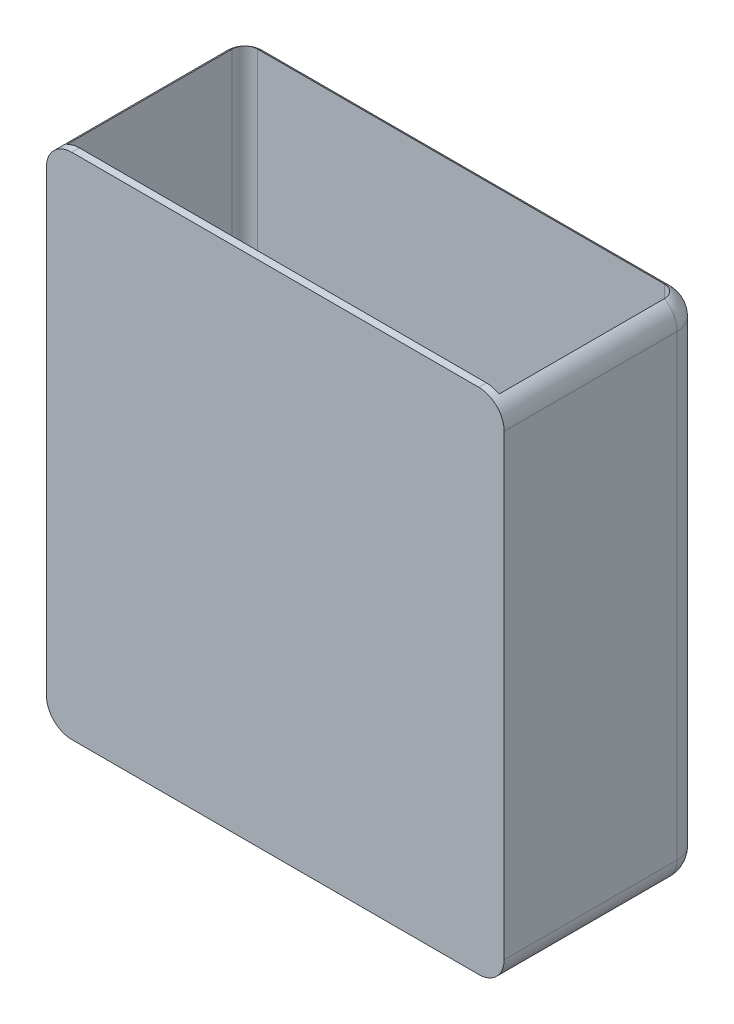
ISO-10303-21;
HEADER;
FILE_DESCRIPTION(('STEP AP214'),'2;1');
FILE_NAME('part.step','',(''),(''),'','','');
FILE_SCHEMA(('AUTOMOTIVE_DESIGN { 1 0 10303 214 1 1 1 1 }'));
ENDSEC;
DATA;
#1=APPLICATION_CONTEXT('core data for automotive mechanical design processes');
#2=APPLICATION_PROTOCOL_DEFINITION('international standard','automotive_design',2000,#1);
#3=PRODUCT_CONTEXT('',#1,'mechanical');
#4=PRODUCT('Part','Part','',(#3));
#5=PRODUCT_RELATED_PRODUCT_CATEGORY('part','',(#4));
#6=PRODUCT_DEFINITION_FORMATION('','',#4);
#7=PRODUCT_DEFINITION_CONTEXT('part definition',#1,'design');
#8=PRODUCT_DEFINITION('design','',#6,#7);
#9=PRODUCT_DEFINITION_SHAPE('','',#8);
#10=(LENGTH_UNIT() NAMED_UNIT(*) SI_UNIT(.MILLI.,.METRE.));
#11=(NAMED_UNIT(*) PLANE_ANGLE_UNIT() SI_UNIT($,.RADIAN.));
#12=(NAMED_UNIT(*) SI_UNIT($,.STERADIAN.) SOLID_ANGLE_UNIT());
#13=UNCERTAINTY_MEASURE_WITH_UNIT(LENGTH_MEASURE(1.E-05),#10,'distance_accuracy_value','');
#14=(GEOMETRIC_REPRESENTATION_CONTEXT(3) GLOBAL_UNCERTAINTY_ASSIGNED_CONTEXT((#13)) GLOBAL_UNIT_ASSIGNED_CONTEXT((#10,
#11,#12)) REPRESENTATION_CONTEXT('',''));
#15=CARTESIAN_POINT('',(0.,0.,0.));
#16=DIRECTION('',(0.,0.,1.));
#17=DIRECTION('',(1.,0.,0.));
#18=AXIS2_PLACEMENT_3D('',#15,#16,#17);
#19=CARTESIAN_POINT('',(90.,-200.,-35.));
#20=DIRECTION('',(1.,0.,0.));
#21=DIRECTION('',(0.,0.,-1.));
#22=AXIS2_PLACEMENT_3D('',#19,#20,#21);
#23=PLANE('',#22);
#24=DIRECTION('',(0.,0.,-1.));
#25=VECTOR('',#24,1.);
#26=CARTESIAN_POINT('',(90.,-10.,-35.));
#27=LINE('',#26,#25);
#28=CARTESIAN_POINT('',(90.,-10.,-35.));
#29=VERTEX_POINT('',#28);
#30=CARTESIAN_POINT('',(90.,-10.,33.));
#31=VERTEX_POINT('',#30);
#32=EDGE_CURVE('E189',#29,#31,#27,.F.);
#33=ORIENTED_EDGE('',*,*,#32,.T.);
#34=DIRECTION('',(0.,-1.,0.));
#35=VECTOR('',#34,1.);
#36=CARTESIAN_POINT('',(90.,-200.,33.));
#37=LINE('',#36,#35);
#38=CARTESIAN_POINT('',(90.,-190.,33.));
#39=VERTEX_POINT('',#38);
#40=EDGE_CURVE('E56',#31,#39,#37,.T.);
#41=ORIENTED_EDGE('',*,*,#40,.T.);
#42=DIRECTION('',(0.,0.,-1.));
#43=VECTOR('',#42,1.);
#44=CARTESIAN_POINT('',(90.,-190.,-35.));
#45=LINE('',#44,#43);
#46=CARTESIAN_POINT('',(90.,-190.,-35.));
#47=VERTEX_POINT('',#46);
#48=EDGE_CURVE('E301',#39,#47,#45,.T.);
#49=ORIENTED_EDGE('',*,*,#48,.T.);
#50=DIRECTION('',(0.,1.,0.));
#51=VECTOR('',#50,1.);
#52=CARTESIAN_POINT('',(90.,-200.,-35.));
#53=LINE('',#52,#51);
#54=EDGE_CURVE('E276',#47,#29,#53,.T.);
#55=ORIENTED_EDGE('',*,*,#54,.T.);
#56=EDGE_LOOP('',(#33,#41,#49,#55));
#57=FACE_BOUND('',#56,.T.);
#58=ADVANCED_FACE('F40',(#57),#23,.T.);
#59=CARTESIAN_POINT('',(-90.,-200.,-35.));
#60=DIRECTION('',(-1.,0.,0.));
#61=DIRECTION('',(0.,0.,1.));
#62=AXIS2_PLACEMENT_3D('',#59,#60,#61);
#63=PLANE('',#62);
#64=DIRECTION('',(0.,0.,1.));
#65=VECTOR('',#64,1.);
#66=CARTESIAN_POINT('',(-90.,-190.,35.));
#67=LINE('',#66,#65);
#68=CARTESIAN_POINT('',(-90.,-190.,-35.));
#69=VERTEX_POINT('',#68);
#70=CARTESIAN_POINT('',(-90.,-190.,33.));
#71=VERTEX_POINT('',#70);
#72=EDGE_CURVE('E326',#69,#71,#67,.T.);
#73=ORIENTED_EDGE('',*,*,#72,.T.);
#74=DIRECTION('',(0.,1.,0.));
#75=VECTOR('',#74,1.);
#76=CARTESIAN_POINT('',(-90.,-200.,33.));
#77=LINE('',#76,#75);
#78=CARTESIAN_POINT('',(-90.,-10.,33.));
#79=VERTEX_POINT('',#78);
#80=EDGE_CURVE('E356',#71,#79,#77,.T.);
#81=ORIENTED_EDGE('',*,*,#80,.T.);
#82=DIRECTION('',(0.,0.,1.));
#83=VECTOR('',#82,1.);
#84=CARTESIAN_POINT('',(-90.,-10.,-35.));
#85=LINE('',#84,#83);
#86=CARTESIAN_POINT('',(-90.,-10.,-35.));
#87=VERTEX_POINT('',#86);
#88=EDGE_CURVE('E204',#79,#87,#85,.F.);
#89=ORIENTED_EDGE('',*,*,#88,.T.);
#90=DIRECTION('',(0.,1.,0.));
#91=VECTOR('',#90,1.);
#92=CARTESIAN_POINT('',(-90.,-200.,-35.));
#93=LINE('',#92,#91);
#94=EDGE_CURVE('E297',#69,#87,#93,.T.);
#95=ORIENTED_EDGE('',*,*,#94,.F.);
#96=EDGE_LOOP('',(#73,#81,#89,#95));
#97=FACE_BOUND('',#96,.T.);
#98=ADVANCED_FACE('F355',(#97),#63,.T.);
#99=CARTESIAN_POINT('',(-80.,-200.,-35.));
#100=DIRECTION('',(0.,1.,0.));
#101=DIRECTION('',(0.,0.,1.));
#102=AXIS2_PLACEMENT_3D('',#99,#100,#101);
#103=PLANE('',#102);
#104=DIRECTION('',(1.,0.,0.));
#105=VECTOR('',#104,1.);
#106=CARTESIAN_POINT('',(-80.,-200.,33.));
#107=LINE('',#106,#105);
#108=CARTESIAN_POINT('',(-80.,-200.,33.));
#109=VERTEX_POINT('',#108);
#110=CARTESIAN_POINT('',(80.,-200.,33.));
#111=VERTEX_POINT('',#110);
#112=EDGE_CURVE('E348',#109,#111,#107,.T.);
#113=ORIENTED_EDGE('',*,*,#112,.F.);
#114=DIRECTION('',(0.,0.,1.));
#115=VECTOR('',#114,1.);
#116=CARTESIAN_POINT('',(-80.,-200.,-35.));
#117=LINE('',#116,#115);
#118=CARTESIAN_POINT('',(-80.,-200.,-35.));
#119=VERTEX_POINT('',#118);
#120=EDGE_CURVE('E316',#109,#119,#117,.F.);
#121=ORIENTED_EDGE('',*,*,#120,.T.);
#122=DIRECTION('',(-1.,0.,0.));
#123=VECTOR('',#122,1.);
#124=CARTESIAN_POINT('',(80.,-200.,-35.));
#125=LINE('',#124,#123);
#126=CARTESIAN_POINT('',(80.,-200.,-35.));
#127=VERTEX_POINT('',#126);
#128=EDGE_CURVE('E313',#119,#127,#125,.F.);
#129=ORIENTED_EDGE('',*,*,#128,.T.);
#130=DIRECTION('',(0.,0.,-1.));
#131=VECTOR('',#130,1.);
#132=CARTESIAN_POINT('',(80.,-200.,35.));
#133=LINE('',#132,#131);
#134=EDGE_CURVE('E319',#127,#111,#133,.F.);
#135=ORIENTED_EDGE('',*,*,#134,.T.);
#136=EDGE_LOOP('',(#113,#121,#129,#135));
#137=FACE_BOUND('',#136,.T.);
#138=ADVANCED_FACE('F346',(#137),#103,.F.);
#139=CARTESIAN_POINT('',(-80.,0.,-35.));
#140=DIRECTION('',(0.,1.,0.));
#141=DIRECTION('',(0.,0.,1.));
#142=AXIS2_PLACEMENT_3D('',#139,#140,#141);
#143=PLANE('',#142);
#144=DIRECTION('',(0.,0.,1.));
#145=VECTOR('',#144,1.);
#146=CARTESIAN_POINT('',(-80.,0.,-35.));
#147=LINE('',#146,#145);
#148=CARTESIAN_POINT('',(-80.,0.,30.));
#149=VERTEX_POINT('',#148);
#150=CARTESIAN_POINT('',(-80.,0.,33.));
#151=VERTEX_POINT('',#150);
#152=EDGE_CURVE('E167',#149,#151,#147,.T.);
#153=ORIENTED_EDGE('',*,*,#152,.T.);
#154=DIRECTION('',(1.,0.,0.));
#155=VECTOR('',#154,1.);
#156=CARTESIAN_POINT('',(-80.,0.,33.));
#157=LINE('',#156,#155);
#158=CARTESIAN_POINT('',(80.,0.,33.));
#159=VERTEX_POINT('',#158);
#160=EDGE_CURVE('E154',#151,#159,#157,.T.);
#161=ORIENTED_EDGE('',*,*,#160,.T.);
#162=DIRECTION('',(0.,0.,-1.));
#163=VECTOR('',#162,1.);
#164=CARTESIAN_POINT('',(80.,0.,-35.));
#165=LINE('',#164,#163);
#166=CARTESIAN_POINT('',(80.,0.,30.));
#167=VERTEX_POINT('',#166);
#168=EDGE_CURVE('E164',#159,#167,#165,.T.);
#169=ORIENTED_EDGE('',*,*,#168,.T.);
#170=DIRECTION('',(1.,0.,0.));
#171=VECTOR('',#170,1.);
#172=CARTESIAN_POINT('',(-85.,0.,30.));
#173=LINE('',#172,#171);
#174=EDGE_CURVE('E255',#149,#167,#173,.T.);
#175=ORIENTED_EDGE('',*,*,#174,.F.);
#176=EDGE_LOOP('',(#153,#161,#169,#175));
#177=FACE_BOUND('',#176,.T.);
#178=ADVANCED_FACE('F162',(#177),#143,.T.);
#179=CARTESIAN_POINT('',(-80.,-190.,-35.));
#180=DIRECTION('',(0.,0.,-1.));
#181=DIRECTION('',(-1.,0.,0.));
#182=AXIS2_PLACEMENT_3D('',#179,#180,#181);
#183=CYLINDRICAL_SURFACE('',#182,10.);
#184=ORIENTED_EDGE('',*,*,#120,.F.);
#185=CARTESIAN_POINT('',(-80.,-190.,33.));
#186=DIRECTION('',(0.,0.,1.));
#187=DIRECTION('',(1.,0.,0.));
#188=AXIS2_PLACEMENT_3D('',#185,#186,#187);
#189=CIRCLE('',#188,10.);
#190=EDGE_CURVE('E219',#109,#71,#189,.F.);
#191=ORIENTED_EDGE('',*,*,#190,.T.);
#192=ORIENTED_EDGE('',*,*,#72,.F.);
#193=CARTESIAN_POINT('',(-80.,-190.,-35.));
#194=DIRECTION('',(0.,0.,-1.));
#195=DIRECTION('',(-1.,0.,0.));
#196=AXIS2_PLACEMENT_3D('',#193,#194,#195);
#197=CIRCLE('',#196,10.);
#198=EDGE_CURVE('E252',#119,#69,#197,.T.);
#199=ORIENTED_EDGE('',*,*,#198,.F.);
#200=EDGE_LOOP('',(#184,#191,#192,#199));
#201=FACE_BOUND('',#200,.T.);
#202=ADVANCED_FACE('F352',(#201),#183,.T.);
#203=CARTESIAN_POINT('',(80.,-190.,-35.));
#204=DIRECTION('',(0.,0.,1.));
#205=DIRECTION('',(1.,0.,0.));
#206=AXIS2_PLACEMENT_3D('',#203,#204,#205);
#207=CYLINDRICAL_SURFACE('',#206,10.);
#208=ORIENTED_EDGE('',*,*,#48,.F.);
#209=CARTESIAN_POINT('',(80.,-190.,33.));
#210=DIRECTION('',(0.,0.,1.));
#211=DIRECTION('',(1.,0.,0.));
#212=AXIS2_PLACEMENT_3D('',#209,#210,#211);
#213=CIRCLE('',#212,10.);
#214=EDGE_CURVE('E619',#39,#111,#213,.F.);
#215=ORIENTED_EDGE('',*,*,#214,.T.);
#216=ORIENTED_EDGE('',*,*,#134,.F.);
#217=CARTESIAN_POINT('',(80.,-190.,-35.));
#218=DIRECTION('',(0.,0.,1.));
#219=DIRECTION('',(1.,0.,0.));
#220=AXIS2_PLACEMENT_3D('',#217,#218,#219);
#221=CIRCLE('',#220,10.);
#222=EDGE_CURVE('E229',#127,#47,#221,.T.);
#223=ORIENTED_EDGE('',*,*,#222,.T.);
#224=EDGE_LOOP('',(#208,#215,#216,#223));
#225=FACE_BOUND('',#224,.T.);
#226=ADVANCED_FACE('F426',(#225),#207,.T.);
#227=CARTESIAN_POINT('',(-80.,-10.,-35.));
#228=DIRECTION('',(0.,0.,1.));
#229=DIRECTION('',(1.,0.,0.));
#230=AXIS2_PLACEMENT_3D('',#227,#228,#229);
#231=CYLINDRICAL_SURFACE('',#230,10.);
#232=ORIENTED_EDGE('',*,*,#88,.F.);
#233=CARTESIAN_POINT('',(-80.,-10.,33.));
#234=DIRECTION('',(0.,0.,1.));
#235=DIRECTION('',(1.,0.,0.));
#236=AXIS2_PLACEMENT_3D('',#233,#234,#235);
#237=CIRCLE('',#236,10.);
#238=EDGE_CURVE('E621',#79,#151,#237,.F.);
#239=ORIENTED_EDGE('',*,*,#238,.T.);
#240=ORIENTED_EDGE('',*,*,#152,.F.);
#241=CARTESIAN_POINT('',(-80.,-10.,30.));
#242=DIRECTION('',(0.,0.,1.));
#243=DIRECTION('',(1.,0.,0.));
#244=AXIS2_PLACEMENT_3D('',#241,#242,#243);
#245=CIRCLE('',#244,10.);
#246=CARTESIAN_POINT('',(-85.,-1.33974596215562,30.));
#247=VERTEX_POINT('',#246);
#248=EDGE_CURVE('E175',#247,#149,#245,.F.);
#249=ORIENTED_EDGE('',*,*,#248,.F.);
#250=DIRECTION('',(0.,0.,1.));
#251=VECTOR('',#250,1.);
#252=CARTESIAN_POINT('',(-85.,-1.33974596215562,-35.));
#253=LINE('',#252,#251);
#254=CARTESIAN_POINT('',(-85.,-1.33974596215561,-35.));
#255=VERTEX_POINT('',#254);
#256=EDGE_CURVE('E201',#255,#247,#253,.T.);
#257=ORIENTED_EDGE('',*,*,#256,.F.);
#258=CARTESIAN_POINT('',(-80.,-10.,-35.));
#259=DIRECTION('',(0.,0.,-1.));
#260=DIRECTION('',(-1.,0.,0.));
#261=AXIS2_PLACEMENT_3D('',#258,#259,#260);
#262=CIRCLE('',#261,10.);
#263=EDGE_CURVE('E226',#87,#255,#262,.T.);
#264=ORIENTED_EDGE('',*,*,#263,.F.);
#265=EDGE_LOOP('',(#232,#239,#240,#249,#257,#264));
#266=FACE_BOUND('',#265,.T.);
#267=ADVANCED_FACE('F42',(#266),#231,.T.);
#268=CARTESIAN_POINT('',(80.,-10.,-35.));
#269=DIRECTION('',(0.,0.,-1.));
#270=DIRECTION('',(-1.,0.,0.));
#271=AXIS2_PLACEMENT_3D('',#268,#269,#270);
#272=CYLINDRICAL_SURFACE('',#271,10.);
#273=ORIENTED_EDGE('',*,*,#168,.F.);
#274=CARTESIAN_POINT('',(80.,-10.,33.));
#275=DIRECTION('',(0.,0.,1.));
#276=DIRECTION('',(1.,0.,0.));
#277=AXIS2_PLACEMENT_3D('',#274,#275,#276);
#278=CIRCLE('',#277,10.);
#279=EDGE_CURVE('E11',#159,#31,#278,.F.);
#280=ORIENTED_EDGE('',*,*,#279,.T.);
#281=ORIENTED_EDGE('',*,*,#32,.F.);
#282=CARTESIAN_POINT('',(80.,-10.,-35.));
#283=DIRECTION('',(0.,0.,1.));
#284=DIRECTION('',(1.,0.,0.));
#285=AXIS2_PLACEMENT_3D('',#282,#283,#284);
#286=CIRCLE('',#285,10.);
#287=CARTESIAN_POINT('',(85.,-1.33974596215564,-35.));
#288=VERTEX_POINT('',#287);
#289=EDGE_CURVE('E214',#29,#288,#286,.T.);
#290=ORIENTED_EDGE('',*,*,#289,.T.);
#291=DIRECTION('',(0.,0.,-1.));
#292=VECTOR('',#291,1.);
#293=CARTESIAN_POINT('',(85.,-1.3397459621556,-35.));
#294=LINE('',#293,#292);
#295=CARTESIAN_POINT('',(85.,-1.33974596215561,30.));
#296=VERTEX_POINT('',#295);
#297=EDGE_CURVE('E186',#296,#288,#294,.T.);
#298=ORIENTED_EDGE('',*,*,#297,.F.);
#299=CARTESIAN_POINT('',(80.,-10.,30.));
#300=DIRECTION('',(0.,0.,1.));
#301=DIRECTION('',(1.,0.,0.));
#302=AXIS2_PLACEMENT_3D('',#299,#300,#301);
#303=CIRCLE('',#302,10.);
#304=EDGE_CURVE('E172',#167,#296,#303,.F.);
#305=ORIENTED_EDGE('',*,*,#304,.F.);
#306=EDGE_LOOP('',(#273,#280,#281,#290,#298,#305));
#307=FACE_BOUND('',#306,.T.);
#308=ADVANCED_FACE('F170',(#307),#272,.T.);
#309=CARTESIAN_POINT('',(-80.,-200.,-35.));
#310=DIRECTION('',(0.,1.,0.));
#311=DIRECTION('',(0.,0.,1.));
#312=AXIS2_PLACEMENT_3D('',#309,#310,#311);
#313=CYLINDRICAL_SURFACE('',#312,10.);
#314=ORIENTED_EDGE('',*,*,#94,.T.);
#315=CARTESIAN_POINT('',(-80.,-10.,-35.));
#316=DIRECTION('',(0.,1.,0.));
#317=DIRECTION('',(0.,0.,1.));
#318=AXIS2_PLACEMENT_3D('',#315,#316,#317);
#319=CIRCLE('',#318,10.);
#320=CARTESIAN_POINT('',(-80.,-10.0000000000001,-45.));
#321=VERTEX_POINT('',#320);
#322=EDGE_CURVE('E207',#87,#321,#319,.F.);
#323=ORIENTED_EDGE('',*,*,#322,.T.);
#324=DIRECTION('',(0.,1.,0.));
#325=VECTOR('',#324,1.);
#326=CARTESIAN_POINT('',(-80.,-200.,-45.));
#327=LINE('',#326,#325);
#328=CARTESIAN_POINT('',(-80.,-190.,-45.));
#329=VERTEX_POINT('',#328);
#330=EDGE_CURVE('E302',#329,#321,#327,.T.);
#331=ORIENTED_EDGE('',*,*,#330,.F.);
#332=CARTESIAN_POINT('',(-80.,-190.,-35.));
#333=DIRECTION('',(0.,1.,0.));
#334=DIRECTION('',(0.,0.,1.));
#335=AXIS2_PLACEMENT_3D('',#332,#333,#334);
#336=CIRCLE('',#335,10.);
#337=EDGE_CURVE('E329',#329,#69,#336,.T.);
#338=ORIENTED_EDGE('',*,*,#337,.T.);
#339=EDGE_LOOP('',(#314,#323,#331,#338));
#340=FACE_BOUND('',#339,.T.);
#341=ADVANCED_FACE('F340',(#340),#313,.T.);
#342=CARTESIAN_POINT('',(-80.,-200.,-45.));
#343=DIRECTION('',(0.,0.,-1.));
#344=DIRECTION('',(-1.,0.,0.));
#345=AXIS2_PLACEMENT_3D('',#342,#343,#344);
#346=PLANE('',#345);
#347=ORIENTED_EDGE('',*,*,#330,.T.);
#348=DIRECTION('',(1.,0.,0.));
#349=VECTOR('',#348,1.);
#350=CARTESIAN_POINT('',(-80.,-10.,-45.));
#351=LINE('',#350,#349);
#352=CARTESIAN_POINT('',(80.,-10.,-45.));
#353=VERTEX_POINT('',#352);
#354=EDGE_CURVE('E63',#321,#353,#351,.T.);
#355=ORIENTED_EDGE('',*,*,#354,.T.);
#356=DIRECTION('',(0.,1.,0.));
#357=VECTOR('',#356,1.);
#358=CARTESIAN_POINT('',(80.,-200.,-45.));
#359=LINE('',#358,#357);
#360=CARTESIAN_POINT('',(80.,-190.,-45.));
#361=VERTEX_POINT('',#360);
#362=EDGE_CURVE('E305',#361,#353,#359,.T.);
#363=ORIENTED_EDGE('',*,*,#362,.F.);
#364=DIRECTION('',(-1.,0.,0.));
#365=VECTOR('',#364,1.);
#366=CARTESIAN_POINT('',(-80.,-190.,-45.));
#367=LINE('',#366,#365);
#368=EDGE_CURVE('E180',#361,#329,#367,.T.);
#369=ORIENTED_EDGE('',*,*,#368,.T.);
#370=EDGE_LOOP('',(#347,#355,#363,#369));
#371=FACE_BOUND('',#370,.T.);
#372=ADVANCED_FACE('F336',(#371),#346,.T.);
#373=CARTESIAN_POINT('',(80.,-200.,-35.));
#374=DIRECTION('',(0.,1.,0.));
#375=DIRECTION('',(0.,0.,1.));
#376=AXIS2_PLACEMENT_3D('',#373,#374,#375);
#377=CYLINDRICAL_SURFACE('',#376,10.);
#378=ORIENTED_EDGE('',*,*,#362,.T.);
#379=CARTESIAN_POINT('',(80.,-10.,-35.));
#380=DIRECTION('',(0.,1.,0.));
#381=DIRECTION('',(0.,0.,1.));
#382=AXIS2_PLACEMENT_3D('',#379,#380,#381);
#383=CIRCLE('',#382,10.);
#384=EDGE_CURVE('E49',#353,#29,#383,.F.);
#385=ORIENTED_EDGE('',*,*,#384,.T.);
#386=ORIENTED_EDGE('',*,*,#54,.F.);
#387=CARTESIAN_POINT('',(80.,-190.,-35.));
#388=DIRECTION('',(0.,1.,0.));
#389=DIRECTION('',(0.,0.,1.));
#390=AXIS2_PLACEMENT_3D('',#387,#388,#389);
#391=CIRCLE('',#390,10.);
#392=EDGE_CURVE('E323',#47,#361,#391,.T.);
#393=ORIENTED_EDGE('',*,*,#392,.T.);
#394=EDGE_LOOP('',(#378,#385,#386,#393));
#395=FACE_BOUND('',#394,.T.);
#396=ADVANCED_FACE('F373',(#395),#377,.T.);
#397=CARTESIAN_POINT('',(-85.,-193.,30.));
#398=DIRECTION('',(0.,0.,1.));
#399=DIRECTION('',(1.,0.,0.));
#400=AXIS2_PLACEMENT_3D('',#397,#398,#399);
#401=PLANE('',#400);
#402=ORIENTED_EDGE('',*,*,#174,.T.);
#403=ORIENTED_EDGE('',*,*,#304,.T.);
#404=DIRECTION('',(0.,1.,0.));
#405=VECTOR('',#404,1.);
#406=CARTESIAN_POINT('',(85.,-193.,30.));
#407=LINE('',#406,#405);
#408=CARTESIAN_POINT('',(85.,-193.,30.));
#409=VERTEX_POINT('',#408);
#410=EDGE_CURVE('E293',#409,#296,#407,.T.);
#411=ORIENTED_EDGE('',*,*,#410,.F.);
#412=DIRECTION('',(1.,0.,0.));
#413=VECTOR('',#412,1.);
#414=CARTESIAN_POINT('',(-85.,-193.,30.));
#415=LINE('',#414,#413);
#416=CARTESIAN_POINT('',(-85.,-193.,30.));
#417=VERTEX_POINT('',#416);
#418=EDGE_CURVE('E261',#417,#409,#415,.T.);
#419=ORIENTED_EDGE('',*,*,#418,.F.);
#420=DIRECTION('',(0.,1.,0.));
#421=VECTOR('',#420,1.);
#422=CARTESIAN_POINT('',(-85.,-193.,30.));
#423=LINE('',#422,#421);
#424=EDGE_CURVE('E272',#417,#247,#423,.T.);
#425=ORIENTED_EDGE('',*,*,#424,.T.);
#426=ORIENTED_EDGE('',*,*,#248,.T.);
#427=EDGE_LOOP('',(#402,#403,#411,#419,#425,#426));
#428=FACE_BOUND('',#427,.T.);
#429=ADVANCED_FACE('F406',(#428),#401,.F.);
#430=CARTESIAN_POINT('',(-85.,-193.,-35.));
#431=DIRECTION('',(-1.,0.,0.));
#432=DIRECTION('',(0.,0.,1.));
#433=AXIS2_PLACEMENT_3D('',#430,#431,#432);
#434=PLANE('',#433);
#435=DIRECTION('',(0.,1.,0.));
#436=VECTOR('',#435,1.);
#437=CARTESIAN_POINT('',(-85.,-193.,-35.));
#438=LINE('',#437,#436);
#439=CARTESIAN_POINT('',(-85.,-193.,-35.));
#440=VERTEX_POINT('',#439);
#441=EDGE_CURVE('E277',#440,#255,#438,.T.);
#442=ORIENTED_EDGE('',*,*,#441,.T.);
#443=ORIENTED_EDGE('',*,*,#256,.T.);
#444=ORIENTED_EDGE('',*,*,#424,.F.);
#445=DIRECTION('',(0.,0.,1.));
#446=VECTOR('',#445,1.);
#447=CARTESIAN_POINT('',(-85.,-193.,-35.));
#448=LINE('',#447,#446);
#449=EDGE_CURVE('E270',#440,#417,#448,.T.);
#450=ORIENTED_EDGE('',*,*,#449,.F.);
#451=EDGE_LOOP('',(#442,#443,#444,#450));
#452=FACE_BOUND('',#451,.T.);
#453=ADVANCED_FACE('F405',(#452),#434,.F.);
#454=CARTESIAN_POINT('',(-80.,-193.,-35.));
#455=DIRECTION('',(0.,1.,0.));
#456=DIRECTION('',(0.,0.,1.));
#457=AXIS2_PLACEMENT_3D('',#454,#455,#456);
#458=CYLINDRICAL_SURFACE('',#457,5.00000000000001);
#459=DIRECTION('',(0.,1.,0.));
#460=VECTOR('',#459,1.);
#461=CARTESIAN_POINT('',(-80.,-193.,-40.));
#462=LINE('',#461,#460);
#463=CARTESIAN_POINT('',(-80.,-193.,-40.));
#464=VERTEX_POINT('',#463);
#465=CARTESIAN_POINT('',(-80.,-1.33974596215564,-40.));
#466=VERTEX_POINT('',#465);
#467=EDGE_CURVE('E281',#464,#466,#462,.T.);
#468=ORIENTED_EDGE('',*,*,#467,.T.);
#469=CARTESIAN_POINT('',(-80.,-1.33974596215563,-35.));
#470=DIRECTION('',(0.,-1.,0.));
#471=DIRECTION('',(0.,0.,-1.));
#472=AXIS2_PLACEMENT_3D('',#469,#470,#471);
#473=CIRCLE('',#472,5.00000000000001);
#474=EDGE_CURVE('E198',#466,#255,#473,.F.);
#475=ORIENTED_EDGE('',*,*,#474,.T.);
#476=ORIENTED_EDGE('',*,*,#441,.F.);
#477=CARTESIAN_POINT('',(-80.,-193.,-35.));
#478=DIRECTION('',(0.,1.,0.));
#479=DIRECTION('',(0.,0.,1.));
#480=AXIS2_PLACEMENT_3D('',#477,#478,#479);
#481=CIRCLE('',#480,5.00000000000001);
#482=EDGE_CURVE('E398',#464,#440,#481,.T.);
#483=ORIENTED_EDGE('',*,*,#482,.F.);
#484=EDGE_LOOP('',(#468,#475,#476,#483));
#485=FACE_BOUND('',#484,.T.);
#486=ADVANCED_FACE('F413',(#485),#458,.F.);
#487=CARTESIAN_POINT('',(80.,-193.,-40.));
#488=DIRECTION('',(0.,0.,-1.));
#489=DIRECTION('',(-1.,0.,0.));
#490=AXIS2_PLACEMENT_3D('',#487,#488,#489);
#491=PLANE('',#490);
#492=DIRECTION('',(0.,1.,0.));
#493=VECTOR('',#492,1.);
#494=CARTESIAN_POINT('',(80.,-193.,-40.));
#495=LINE('',#494,#493);
#496=CARTESIAN_POINT('',(80.,-193.,-40.));
#497=VERTEX_POINT('',#496);
#498=CARTESIAN_POINT('',(80.,-1.33974596215561,-40.));
#499=VERTEX_POINT('',#498);
#500=EDGE_CURVE('E285',#497,#499,#495,.T.);
#501=ORIENTED_EDGE('',*,*,#500,.T.);
#502=DIRECTION('',(1.,0.,0.));
#503=VECTOR('',#502,1.);
#504=CARTESIAN_POINT('',(-80.,-1.33974596215562,-40.));
#505=LINE('',#504,#503);
#506=EDGE_CURVE('E195',#499,#466,#505,.F.);
#507=ORIENTED_EDGE('',*,*,#506,.T.);
#508=ORIENTED_EDGE('',*,*,#467,.F.);
#509=DIRECTION('',(-1.,0.,0.));
#510=VECTOR('',#509,1.);
#511=CARTESIAN_POINT('',(80.,-193.,-40.));
#512=LINE('',#511,#510);
#513=EDGE_CURVE('E388',#497,#464,#512,.T.);
#514=ORIENTED_EDGE('',*,*,#513,.F.);
#515=EDGE_LOOP('',(#501,#507,#508,#514));
#516=FACE_BOUND('',#515,.T.);
#517=ADVANCED_FACE('F548',(#516),#491,.F.);
#518=CARTESIAN_POINT('',(80.,-193.,-35.));
#519=DIRECTION('',(0.,1.,0.));
#520=DIRECTION('',(0.,0.,1.));
#521=AXIS2_PLACEMENT_3D('',#518,#519,#520);
#522=CYLINDRICAL_SURFACE('',#521,5.00000000000001);
#523=DIRECTION('',(0.,1.,0.));
#524=VECTOR('',#523,1.);
#525=CARTESIAN_POINT('',(85.,-193.,-35.));
#526=LINE('',#525,#524);
#527=CARTESIAN_POINT('',(85.,-193.,-35.));
#528=VERTEX_POINT('',#527);
#529=EDGE_CURVE('E289',#528,#288,#526,.T.);
#530=ORIENTED_EDGE('',*,*,#529,.T.);
#531=CARTESIAN_POINT('',(80.,-1.33974596215563,-35.));
#532=DIRECTION('',(0.,-1.,0.));
#533=DIRECTION('',(0.,0.,-1.));
#534=AXIS2_PLACEMENT_3D('',#531,#532,#533);
#535=CIRCLE('',#534,5.00000000000001);
#536=EDGE_CURVE('E192',#288,#499,#535,.F.);
#537=ORIENTED_EDGE('',*,*,#536,.T.);
#538=ORIENTED_EDGE('',*,*,#500,.F.);
#539=CARTESIAN_POINT('',(80.,-193.,-35.));
#540=DIRECTION('',(0.,1.,0.));
#541=DIRECTION('',(0.,0.,1.));
#542=AXIS2_PLACEMENT_3D('',#539,#540,#541);
#543=CIRCLE('',#542,5.00000000000001);
#544=EDGE_CURVE('E382',#528,#497,#543,.T.);
#545=ORIENTED_EDGE('',*,*,#544,.F.);
#546=EDGE_LOOP('',(#530,#537,#538,#545));
#547=FACE_BOUND('',#546,.T.);
#548=ADVANCED_FACE('F380',(#547),#522,.F.);
#549=CARTESIAN_POINT('',(85.,-193.,30.));
#550=DIRECTION('',(1.,0.,0.));
#551=DIRECTION('',(0.,0.,-1.));
#552=AXIS2_PLACEMENT_3D('',#549,#550,#551);
#553=PLANE('',#552);
#554=ORIENTED_EDGE('',*,*,#410,.T.);
#555=ORIENTED_EDGE('',*,*,#297,.T.);
#556=ORIENTED_EDGE('',*,*,#529,.F.);
#557=DIRECTION('',(0.,0.,-1.));
#558=VECTOR('',#557,1.);
#559=CARTESIAN_POINT('',(85.,-193.,30.));
#560=LINE('',#559,#558);
#561=EDGE_CURVE('E266',#409,#528,#560,.T.);
#562=ORIENTED_EDGE('',*,*,#561,.F.);
#563=EDGE_LOOP('',(#554,#555,#556,#562));
#564=FACE_BOUND('',#563,.T.);
#565=ADVANCED_FACE('F376',(#564),#553,.F.);
#566=CARTESIAN_POINT('',(80.,-193.,-35.));
#567=DIRECTION('',(0.,1.,0.));
#568=DIRECTION('',(0.,0.,1.));
#569=AXIS2_PLACEMENT_3D('',#566,#567,#568);
#570=PLANE('',#569);
#571=ORIENTED_EDGE('',*,*,#418,.T.);
#572=ORIENTED_EDGE('',*,*,#561,.T.);
#573=ORIENTED_EDGE('',*,*,#544,.T.);
#574=ORIENTED_EDGE('',*,*,#513,.T.);
#575=ORIENTED_EDGE('',*,*,#482,.T.);
#576=ORIENTED_EDGE('',*,*,#449,.T.);
#577=EDGE_LOOP('',(#571,#572,#573,#574,#575,#576));
#578=FACE_BOUND('',#577,.T.);
#579=ADVANCED_FACE('F390',(#578),#570,.T.);
#580=CARTESIAN_POINT('',(-80.,-190.,-35.));
#581=DIRECTION('',(0.,1.,0.));
#582=DIRECTION('',(0.,0.,1.));
#583=AXIS2_PLACEMENT_3D('',#580,#581,#582);
#584=SPHERICAL_SURFACE('',#583,10.);
#585=ORIENTED_EDGE('',*,*,#198,.T.);
#586=ORIENTED_EDGE('',*,*,#337,.F.);
#587=CARTESIAN_POINT('',(-80.,-190.,-35.));
#588=DIRECTION('',(1.,0.,0.));
#589=DIRECTION('',(0.,0.,-1.));
#590=AXIS2_PLACEMENT_3D('',#587,#588,#589);
#591=CIRCLE('',#590,10.);
#592=EDGE_CURVE('E245',#119,#329,#591,.T.);
#593=ORIENTED_EDGE('',*,*,#592,.F.);
#594=EDGE_LOOP('',(#585,#586,#593));
#595=FACE_BOUND('',#594,.T.);
#596=ADVANCED_FACE('F341',(#595),#584,.T.);
#597=CARTESIAN_POINT('',(-80.,-190.,-35.));
#598=DIRECTION('',(1.,0.,0.));
#599=DIRECTION('',(0.,0.,-1.));
#600=AXIS2_PLACEMENT_3D('',#597,#598,#599);
#601=CYLINDRICAL_SURFACE('',#600,10.);
#602=ORIENTED_EDGE('',*,*,#592,.T.);
#603=ORIENTED_EDGE('',*,*,#368,.F.);
#604=CARTESIAN_POINT('',(80.,-190.,-35.));
#605=DIRECTION('',(1.,0.,0.));
#606=DIRECTION('',(0.,0.,-1.));
#607=AXIS2_PLACEMENT_3D('',#604,#605,#606);
#608=CIRCLE('',#607,10.);
#609=EDGE_CURVE('E236',#127,#361,#608,.T.);
#610=ORIENTED_EDGE('',*,*,#609,.F.);
#611=ORIENTED_EDGE('',*,*,#128,.F.);
#612=EDGE_LOOP('',(#602,#603,#610,#611));
#613=FACE_BOUND('',#612,.T.);
#614=ADVANCED_FACE('F343',(#613),#601,.T.);
#615=CARTESIAN_POINT('',(80.,-190.,-35.));
#616=DIRECTION('',(0.,1.,0.));
#617=DIRECTION('',(0.,0.,1.));
#618=AXIS2_PLACEMENT_3D('',#615,#616,#617);
#619=SPHERICAL_SURFACE('',#618,10.);
#620=ORIENTED_EDGE('',*,*,#609,.T.);
#621=ORIENTED_EDGE('',*,*,#392,.F.);
#622=ORIENTED_EDGE('',*,*,#222,.F.);
#623=EDGE_LOOP('',(#620,#621,#622));
#624=FACE_BOUND('',#623,.T.);
#625=ADVANCED_FACE('F429',(#624),#619,.T.);
#626=CARTESIAN_POINT('',(-80.,-10.,-35.));
#627=DIRECTION('',(0.,1.,0.));
#628=DIRECTION('',(0.,0.,1.));
#629=AXIS2_PLACEMENT_3D('',#626,#627,#628);
#630=SPHERICAL_SURFACE('',#629,10.);
#631=ORIENTED_EDGE('',*,*,#263,.T.);
#632=ORIENTED_EDGE('',*,*,#474,.F.);
#633=CARTESIAN_POINT('',(-80.,-10.,-35.));
#634=DIRECTION('',(1.,0.,0.));
#635=DIRECTION('',(0.,0.,-1.));
#636=AXIS2_PLACEMENT_3D('',#633,#634,#635);
#637=CIRCLE('',#636,10.);
#638=EDGE_CURVE('E223',#321,#466,#637,.T.);
#639=ORIENTED_EDGE('',*,*,#638,.F.);
#640=ORIENTED_EDGE('',*,*,#322,.F.);
#641=EDGE_LOOP('',(#631,#632,#639,#640));
#642=FACE_BOUND('',#641,.T.);
#643=ADVANCED_FACE('F361',(#642),#630,.T.);
#644=CARTESIAN_POINT('',(-80.,-10.,-35.));
#645=DIRECTION('',(1.,0.,0.));
#646=DIRECTION('',(0.,0.,-1.));
#647=AXIS2_PLACEMENT_3D('',#644,#645,#646);
#648=CYLINDRICAL_SURFACE('',#647,10.);
#649=ORIENTED_EDGE('',*,*,#638,.T.);
#650=ORIENTED_EDGE('',*,*,#506,.F.);
#651=CARTESIAN_POINT('',(80.,-10.,-35.));
#652=DIRECTION('',(1.,0.,0.));
#653=DIRECTION('',(0.,0.,-1.));
#654=AXIS2_PLACEMENT_3D('',#651,#652,#653);
#655=CIRCLE('',#654,10.);
#656=EDGE_CURVE('E218',#353,#499,#655,.T.);
#657=ORIENTED_EDGE('',*,*,#656,.F.);
#658=ORIENTED_EDGE('',*,*,#354,.F.);
#659=EDGE_LOOP('',(#649,#650,#657,#658));
#660=FACE_BOUND('',#659,.T.);
#661=ADVANCED_FACE('F365',(#660),#648,.T.);
#662=CARTESIAN_POINT('',(80.,-10.,-35.));
#663=DIRECTION('',(0.,1.,0.));
#664=DIRECTION('',(0.,0.,1.));
#665=AXIS2_PLACEMENT_3D('',#662,#663,#664);
#666=SPHERICAL_SURFACE('',#665,10.);
#667=ORIENTED_EDGE('',*,*,#656,.T.);
#668=ORIENTED_EDGE('',*,*,#536,.F.);
#669=ORIENTED_EDGE('',*,*,#289,.F.);
#670=ORIENTED_EDGE('',*,*,#384,.F.);
#671=EDGE_LOOP('',(#667,#668,#669,#670));
#672=FACE_BOUND('',#671,.T.);
#673=ADVANCED_FACE('F370',(#672),#666,.T.);
#674=CARTESIAN_POINT('',(0.,0.,33.));
#675=DIRECTION('',(0.,0.,1.));
#676=DIRECTION('',(1.,0.,0.));
#677=AXIS2_PLACEMENT_3D('',#674,#675,#676);
#678=PLANE('',#677);
#679=ORIENTED_EDGE('',*,*,#112,.T.);
#680=ORIENTED_EDGE('',*,*,#214,.F.);
#681=ORIENTED_EDGE('',*,*,#40,.F.);
#682=ORIENTED_EDGE('',*,*,#279,.F.);
#683=ORIENTED_EDGE('',*,*,#160,.F.);
#684=ORIENTED_EDGE('',*,*,#238,.F.);
#685=ORIENTED_EDGE('',*,*,#80,.F.);
#686=ORIENTED_EDGE('',*,*,#190,.F.);
#687=EDGE_LOOP('',(#679,#680,#681,#682,#683,#684,#685,#686));
#688=FACE_BOUND('',#687,.T.);
#689=ADVANCED_FACE('F153',(#688),#678,.T.);
#690=CLOSED_SHELL('',(#58,#98,#138,#178,#202,#226,#267,#308,#341,#372,#396,#429,#453,#486,#517,
#548,#565,#579,#596,#614,#625,#643,#661,#673,#689));
#691=MANIFOLD_SOLID_BREP('B2',#690);
#692=ADVANCED_BREP_SHAPE_REPRESENTATION('',(#18,#691),#14);
#693=SHAPE_DEFINITION_REPRESENTATION(#9,#692);
ENDSEC;
END-ISO-10303-21;
